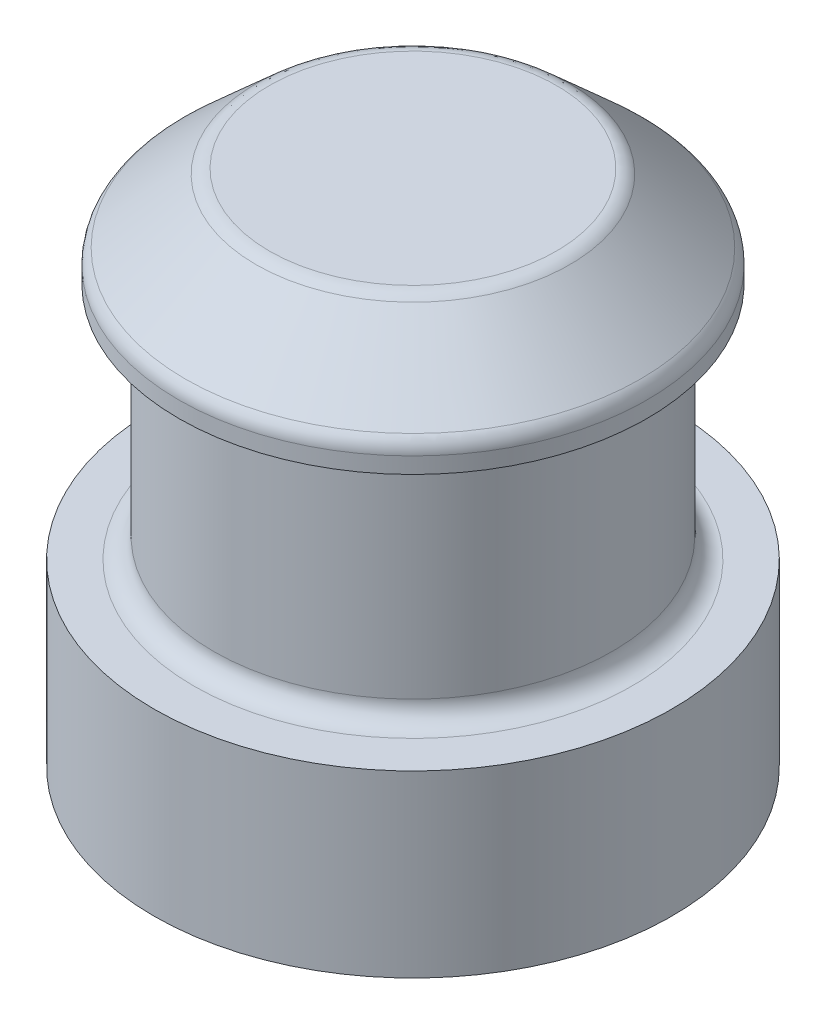
ISO-10303-21;
HEADER;
FILE_DESCRIPTION(('STEP AP214'),'2;1');
FILE_NAME('part.step','',(''),(''),'','','');
FILE_SCHEMA(('AUTOMOTIVE_DESIGN { 1 0 10303 214 1 1 1 1 }'));
ENDSEC;
DATA;
#1=APPLICATION_CONTEXT('core data for automotive mechanical design processes');
#2=APPLICATION_PROTOCOL_DEFINITION('international standard','automotive_design',2000,#1);
#3=PRODUCT_CONTEXT('',#1,'mechanical');
#4=PRODUCT('Part','Part','',(#3));
#5=PRODUCT_RELATED_PRODUCT_CATEGORY('part','',(#4));
#6=PRODUCT_DEFINITION_FORMATION('','',#4);
#7=PRODUCT_DEFINITION_CONTEXT('part definition',#1,'design');
#8=PRODUCT_DEFINITION('design','',#6,#7);
#9=PRODUCT_DEFINITION_SHAPE('','',#8);
#10=(LENGTH_UNIT() NAMED_UNIT(*) SI_UNIT(.MILLI.,.METRE.));
#11=(NAMED_UNIT(*) PLANE_ANGLE_UNIT() SI_UNIT($,.RADIAN.));
#12=(NAMED_UNIT(*) SI_UNIT($,.STERADIAN.) SOLID_ANGLE_UNIT());
#13=UNCERTAINTY_MEASURE_WITH_UNIT(LENGTH_MEASURE(1.E-05),#10,'distance_accuracy_value','');
#14=(GEOMETRIC_REPRESENTATION_CONTEXT(3) GLOBAL_UNCERTAINTY_ASSIGNED_CONTEXT((#13)) GLOBAL_UNIT_ASSIGNED_CONTEXT((#10,
#11,#12)) REPRESENTATION_CONTEXT('',''));
#15=CARTESIAN_POINT('',(0.,0.,0.));
#16=DIRECTION('',(0.,0.,1.));
#17=DIRECTION('',(1.,0.,0.));
#18=AXIS2_PLACEMENT_3D('',#15,#16,#17);
#19=CARTESIAN_POINT('',(0.,1.72796130348459,0.));
#20=DIRECTION('',(0.,-1.,0.));
#21=DIRECTION('',(0.,0.,-1.));
#22=AXIS2_PLACEMENT_3D('',#19,#20,#21);
#23=CYLINDRICAL_SURFACE('',#22,2.99);
#24=CARTESIAN_POINT('',(0.,1.72796130348459,0.));
#25=DIRECTION('',(0.,1.,0.));
#26=DIRECTION('',(0.,0.,1.));
#27=AXIS2_PLACEMENT_3D('',#24,#25,#26);
#28=CIRCLE('',#27,2.99);
#29=CARTESIAN_POINT('',(0.,1.72796130348459,2.99));
#30=VERTEX_POINT('',#29);
#31=EDGE_CURVE('E62',#30,#30,#28,.T.);
#32=ORIENTED_EDGE('',*,*,#31,.F.);
#33=EDGE_LOOP('',(#32));
#34=FACE_BOUND('',#33,.T.);
#35=CARTESIAN_POINT('',(0.,-0.342038696515414,0.));
#36=DIRECTION('',(0.,1.,0.));
#37=DIRECTION('',(0.,0.,1.));
#38=AXIS2_PLACEMENT_3D('',#35,#36,#37);
#39=CIRCLE('',#38,2.99);
#40=CARTESIAN_POINT('',(0.,-0.342038696515414,2.99));
#41=VERTEX_POINT('',#40);
#42=EDGE_CURVE('E63',#41,#41,#39,.T.);
#43=ORIENTED_EDGE('',*,*,#42,.T.);
#44=EDGE_LOOP('',(#43));
#45=FACE_BOUND('',#44,.T.);
#46=ADVANCED_FACE('F36',(#34,#45),#23,.T.);
#47=CARTESIAN_POINT('',(0.,1.72796130348459,0.));
#48=DIRECTION('',(0.,1.,0.));
#49=DIRECTION('',(0.,0.,1.));
#50=AXIS2_PLACEMENT_3D('',#47,#48,#49);
#51=PLANE('',#50);
#52=CARTESIAN_POINT('',(0.,1.72796130348459,0.));
#53=DIRECTION('',(0.,1.,0.));
#54=DIRECTION('',(0.,0.,1.));
#55=AXIS2_PLACEMENT_3D('',#52,#53,#54);
#56=CIRCLE('',#55,2.53);
#57=CARTESIAN_POINT('',(0.,1.72796130348459,2.53));
#58=VERTEX_POINT('',#57);
#59=EDGE_CURVE('E10',#58,#58,#56,.F.);
#60=ORIENTED_EDGE('',*,*,#59,.T.);
#61=EDGE_LOOP('',(#60));
#62=FACE_BOUND('',#61,.T.);
#63=ORIENTED_EDGE('',*,*,#31,.T.);
#64=EDGE_LOOP('',(#63));
#65=FACE_BOUND('',#64,.T.);
#66=ADVANCED_FACE('F94',(#62,#65),#51,.T.);
#67=CARTESIAN_POINT('',(0.,-0.342038696515414,0.));
#68=DIRECTION('',(0.,1.,0.));
#69=DIRECTION('',(0.,0.,1.));
#70=AXIS2_PLACEMENT_3D('',#67,#68,#69);
#71=PLANE('',#70);
#72=ORIENTED_EDGE('',*,*,#42,.F.);
#73=EDGE_LOOP('',(#72));
#74=FACE_BOUND('',#73,.T.);
#75=ADVANCED_FACE('F100',(#74),#71,.F.);
#76=CARTESIAN_POINT('',(0.,4.48796130348459,0.));
#77=DIRECTION('',(0.,-1.,0.));
#78=DIRECTION('',(0.,0.,-1.));
#79=AXIS2_PLACEMENT_3D('',#76,#77,#78);
#80=CYLINDRICAL_SURFACE('',#79,2.3);
#81=CARTESIAN_POINT('',(0.,1.95796130348459,0.));
#82=DIRECTION('',(0.,1.,0.));
#83=DIRECTION('',(0.,0.,1.));
#84=AXIS2_PLACEMENT_3D('',#81,#82,#83);
#85=CIRCLE('',#84,2.3);
#86=CARTESIAN_POINT('',(0.,1.95796130348459,2.3));
#87=VERTEX_POINT('',#86);
#88=EDGE_CURVE('E43',#87,#87,#85,.T.);
#89=ORIENTED_EDGE('',*,*,#88,.T.);
#90=EDGE_LOOP('',(#89));
#91=FACE_BOUND('',#90,.T.);
#92=CARTESIAN_POINT('',(0.,4.48796130348459,0.));
#93=DIRECTION('',(0.,1.,0.));
#94=DIRECTION('',(0.,0.,1.));
#95=AXIS2_PLACEMENT_3D('',#92,#93,#94);
#96=CIRCLE('',#95,2.3);
#97=CARTESIAN_POINT('',(0.,4.48796130348459,2.3));
#98=VERTEX_POINT('',#97);
#99=EDGE_CURVE('E66',#98,#98,#96,.T.);
#100=ORIENTED_EDGE('',*,*,#99,.F.);
#101=EDGE_LOOP('',(#100));
#102=FACE_BOUND('',#101,.T.);
#103=ADVANCED_FACE('F120',(#91,#102),#80,.T.);
#104=CARTESIAN_POINT('',(0.,5.63796130348458,0.));
#105=DIRECTION('',(0.,-1.,0.));
#106=DIRECTION('',(0.,0.,-1.));
#107=AXIS2_PLACEMENT_3D('',#104,#105,#106);
#108=CYLINDRICAL_SURFACE('',#107,2.7025);
#109=CARTESIAN_POINT('',(0.,4.67305870586362,0.));
#110=DIRECTION('',(0.,1.,0.));
#111=DIRECTION('',(0.,0.,1.));
#112=AXIS2_PLACEMENT_3D('',#109,#110,#111);
#113=CIRCLE('',#112,2.7025);
#114=CARTESIAN_POINT('',(0.,4.67305870586362,2.7025));
#115=VERTEX_POINT('',#114);
#116=EDGE_CURVE('E47',#115,#115,#113,.F.);
#117=ORIENTED_EDGE('',*,*,#116,.T.);
#118=EDGE_LOOP('',(#117));
#119=FACE_BOUND('',#118,.T.);
#120=CARTESIAN_POINT('',(0.,4.48796130348459,0.));
#121=DIRECTION('',(0.,1.,0.));
#122=DIRECTION('',(0.,0.,1.));
#123=AXIS2_PLACEMENT_3D('',#120,#121,#122);
#124=CIRCLE('',#123,2.7025);
#125=CARTESIAN_POINT('',(0.,4.48796130348459,2.7025));
#126=VERTEX_POINT('',#125);
#127=EDGE_CURVE('E71',#126,#126,#124,.T.);
#128=ORIENTED_EDGE('',*,*,#127,.T.);
#129=EDGE_LOOP('',(#128));
#130=FACE_BOUND('',#129,.T.);
#131=ADVANCED_FACE('F75',(#119,#130),#108,.T.);
#132=CARTESIAN_POINT('',(0.,5.63796130348458,0.));
#133=DIRECTION('',(0.,1.,0.));
#134=DIRECTION('',(0.,0.,1.));
#135=AXIS2_PLACEMENT_3D('',#132,#133,#134);
#136=PLANE('',#135);
#137=CARTESIAN_POINT('',(0.,5.63796130348458,0.));
#138=DIRECTION('',(0.,1.,0.));
#139=DIRECTION('',(0.,0.,1.));
#140=AXIS2_PLACEMENT_3D('',#137,#138,#139);
#141=CIRCLE('',#140,1.65630797790167);
#142=CARTESIAN_POINT('',(0.,5.63796130348458,1.65630797790167));
#143=VERTEX_POINT('',#142);
#144=EDGE_CURVE('E59',#143,#143,#141,.T.);
#145=ORIENTED_EDGE('',*,*,#144,.T.);
#146=EDGE_LOOP('',(#145));
#147=FACE_BOUND('',#146,.T.);
#148=ADVANCED_FACE('F80',(#147),#136,.T.);
#149=CARTESIAN_POINT('',(0.,4.48796130348459,0.));
#150=DIRECTION('',(0.,1.,0.));
#151=DIRECTION('',(0.,0.,1.));
#152=AXIS2_PLACEMENT_3D('',#149,#150,#151);
#153=PLANE('',#152);
#154=ORIENTED_EDGE('',*,*,#99,.T.);
#155=EDGE_LOOP('',(#154));
#156=FACE_BOUND('',#155,.T.);
#157=ORIENTED_EDGE('',*,*,#127,.F.);
#158=EDGE_LOOP('',(#157));
#159=FACE_BOUND('',#158,.T.);
#160=ADVANCED_FACE('F77',(#156,#159),#153,.F.);
#161=CARTESIAN_POINT('',(0.,5.63796130348458,0.));
#162=DIRECTION('',(0.,-1.,0.));
#163=DIRECTION('',(0.,0.,-1.));
#164=AXIS2_PLACEMENT_3D('',#161,#162,#163);
#165=CONICAL_SURFACE('',#164,1.74459670595982,0.837758040957276);
#166=CARTESIAN_POINT('',(0.,5.57888461334439,0.));
#167=DIRECTION('',(0.,1.,0.));
#168=DIRECTION('',(0.,0.,1.));
#169=AXIS2_PLACEMENT_3D('',#166,#167,#168);
#170=CIRCLE('',#169,1.81020801736421);
#171=CARTESIAN_POINT('',(0.,5.57888461334439,1.81020801736421));
#172=VERTEX_POINT('',#171);
#173=EDGE_CURVE('E51',#172,#172,#170,.F.);
#174=ORIENTED_EDGE('',*,*,#173,.T.);
#175=EDGE_LOOP('',(#174));
#176=FACE_BOUND('',#175,.T.);
#177=CARTESIAN_POINT('',(0.,4.84398201572342,0.));
#178=DIRECTION('',(0.,-1.,0.));
#179=DIRECTION('',(0.,0.,-1.));
#180=AXIS2_PLACEMENT_3D('',#177,#178,#179);
#181=CIRCLE('',#180,2.62640003946254);
#182=CARTESIAN_POINT('',(0.,4.84398201572342,-2.62640003946254));
#183=VERTEX_POINT('',#182);
#184=EDGE_CURVE('E56',#183,#183,#181,.F.);
#185=ORIENTED_EDGE('',*,*,#184,.T.);
#186=EDGE_LOOP('',(#185));
#187=FACE_BOUND('',#186,.T.);
#188=ADVANCED_FACE('F79',(#176,#187),#165,.T.);
#189=CARTESIAN_POINT('',(0.,5.40796130348459,0.));
#190=DIRECTION('',(0.,1.,0.));
#191=DIRECTION('',(0.,0.,1.));
#192=AXIS2_PLACEMENT_3D('',#189,#190,#191);
#193=TOROIDAL_SURFACE('',#192,1.65630797790167,0.23);
#194=ORIENTED_EDGE('',*,*,#173,.F.);
#195=EDGE_LOOP('',(#194));
#196=FACE_BOUND('',#195,.T.);
#197=ORIENTED_EDGE('',*,*,#144,.F.);
#198=EDGE_LOOP('',(#197));
#199=FACE_BOUND('',#198,.T.);
#200=ADVANCED_FACE('F87',(#196,#199),#193,.T.);
#201=CARTESIAN_POINT('',(0.,4.67305870586362,0.));
#202=DIRECTION('',(0.,1.,0.));
#203=DIRECTION('',(0.,0.,1.));
#204=AXIS2_PLACEMENT_3D('',#201,#202,#203);
#205=TOROIDAL_SURFACE('',#204,2.4725,0.23);
#206=ORIENTED_EDGE('',*,*,#184,.F.);
#207=EDGE_LOOP('',(#206));
#208=FACE_BOUND('',#207,.T.);
#209=ORIENTED_EDGE('',*,*,#116,.F.);
#210=EDGE_LOOP('',(#209));
#211=FACE_BOUND('',#210,.T.);
#212=ADVANCED_FACE('F107',(#208,#211),#205,.T.);
#213=CARTESIAN_POINT('',(0.,1.95796130348459,0.));
#214=DIRECTION('',(0.,1.,0.));
#215=DIRECTION('',(0.,0.,1.));
#216=AXIS2_PLACEMENT_3D('',#213,#214,#215);
#217=TOROIDAL_SURFACE('',#216,2.53,0.23);
#218=ORIENTED_EDGE('',*,*,#59,.F.);
#219=EDGE_LOOP('',(#218));
#220=FACE_BOUND('',#219,.T.);
#221=ORIENTED_EDGE('',*,*,#88,.F.);
#222=EDGE_LOOP('',(#221));
#223=FACE_BOUND('',#222,.T.);
#224=ADVANCED_FACE('F38',(#220,#223),#217,.F.);
#225=CLOSED_SHELL('',(#46,#66,#75,#103,#131,#148,#160,#188,#200,#212,#224));
#226=MANIFOLD_SOLID_BREP('B2',#225);
#227=ADVANCED_BREP_SHAPE_REPRESENTATION('',(#18,#226),#14);
#228=SHAPE_DEFINITION_REPRESENTATION(#9,#227);
ENDSEC;
END-ISO-10303-21;
